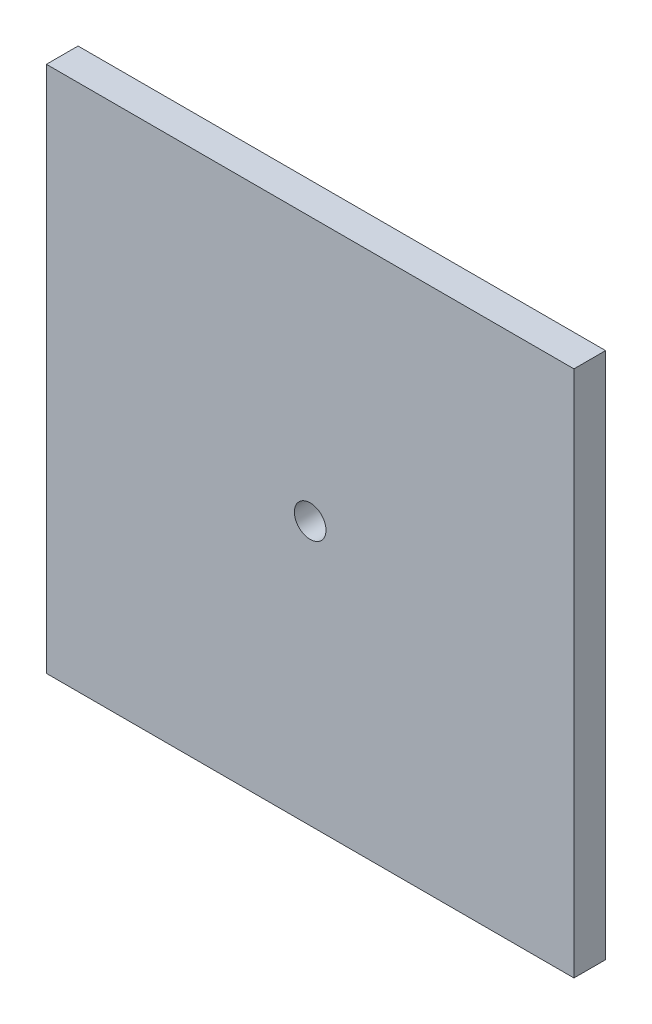
ISO-10303-21;
HEADER;
FILE_DESCRIPTION(('STEP AP214'),'2;1');
FILE_NAME('part.step','',(''),(''),'','','');
FILE_SCHEMA(('AUTOMOTIVE_DESIGN { 1 0 10303 214 1 1 1 1 }'));
ENDSEC;
DATA;
#1=APPLICATION_CONTEXT('core data for automotive mechanical design processes');
#2=APPLICATION_PROTOCOL_DEFINITION('international standard','automotive_design',2000,#1);
#3=PRODUCT_CONTEXT('',#1,'mechanical');
#4=PRODUCT('Part','Part','',(#3));
#5=PRODUCT_RELATED_PRODUCT_CATEGORY('part','',(#4));
#6=PRODUCT_DEFINITION_FORMATION('','',#4);
#7=PRODUCT_DEFINITION_CONTEXT('part definition',#1,'design');
#8=PRODUCT_DEFINITION('design','',#6,#7);
#9=PRODUCT_DEFINITION_SHAPE('','',#8);
#10=(LENGTH_UNIT() NAMED_UNIT(*) SI_UNIT(.MILLI.,.METRE.));
#11=(NAMED_UNIT(*) PLANE_ANGLE_UNIT() SI_UNIT($,.RADIAN.));
#12=(NAMED_UNIT(*) SI_UNIT($,.STERADIAN.) SOLID_ANGLE_UNIT());
#13=UNCERTAINTY_MEASURE_WITH_UNIT(LENGTH_MEASURE(1.E-05),#10,'distance_accuracy_value','');
#14=(GEOMETRIC_REPRESENTATION_CONTEXT(3) GLOBAL_UNCERTAINTY_ASSIGNED_CONTEXT((#13)) GLOBAL_UNIT_ASSIGNED_CONTEXT((#10,
#11,#12)) REPRESENTATION_CONTEXT('',''));
#15=CARTESIAN_POINT('',(0.,0.,0.));
#16=DIRECTION('',(0.,0.,1.));
#17=DIRECTION('',(1.,0.,0.));
#18=AXIS2_PLACEMENT_3D('',#15,#16,#17);
#19=CARTESIAN_POINT('',(25.,25.,3.));
#20=DIRECTION('',(-1.,0.,0.));
#21=DIRECTION('',(0.,-1.,0.));
#22=AXIS2_PLACEMENT_3D('',#19,#20,#21);
#23=PLANE('',#22);
#24=DIRECTION('',(0.,1.,0.));
#25=VECTOR('',#24,1.);
#26=CARTESIAN_POINT('',(25.,25.,0.));
#27=LINE('',#26,#25);
#28=CARTESIAN_POINT('',(25.,-25.,0.));
#29=VERTEX_POINT('',#28);
#30=CARTESIAN_POINT('',(25.,25.,0.));
#31=VERTEX_POINT('',#30);
#32=EDGE_CURVE('E99',#29,#31,#27,.T.);
#33=ORIENTED_EDGE('',*,*,#32,.T.);
#34=DIRECTION('',(0.,0.,-1.));
#35=VECTOR('',#34,1.);
#36=CARTESIAN_POINT('',(25.,25.,3.));
#37=LINE('',#36,#35);
#38=CARTESIAN_POINT('',(25.,25.,3.));
#39=VERTEX_POINT('',#38);
#40=EDGE_CURVE('E11',#39,#31,#37,.T.);
#41=ORIENTED_EDGE('',*,*,#40,.F.);
#42=DIRECTION('',(0.,1.,0.));
#43=VECTOR('',#42,1.);
#44=CARTESIAN_POINT('',(25.,25.,3.));
#45=LINE('',#44,#43);
#46=CARTESIAN_POINT('',(25.,-25.,3.));
#47=VERTEX_POINT('',#46);
#48=EDGE_CURVE('E87',#47,#39,#45,.T.);
#49=ORIENTED_EDGE('',*,*,#48,.F.);
#50=DIRECTION('',(0.,0.,-1.));
#51=VECTOR('',#50,1.);
#52=CARTESIAN_POINT('',(25.,-25.,3.));
#53=LINE('',#52,#51);
#54=EDGE_CURVE('E95',#47,#29,#53,.T.);
#55=ORIENTED_EDGE('',*,*,#54,.T.);
#56=EDGE_LOOP('',(#33,#41,#49,#55));
#57=FACE_BOUND('',#56,.T.);
#58=ADVANCED_FACE('F36',(#57),#23,.F.);
#59=CARTESIAN_POINT('',(-25.,25.,3.));
#60=DIRECTION('',(0.,-1.,0.));
#61=DIRECTION('',(0.,0.,-1.));
#62=AXIS2_PLACEMENT_3D('',#59,#60,#61);
#63=PLANE('',#62);
#64=DIRECTION('',(-1.,0.,0.));
#65=VECTOR('',#64,1.);
#66=CARTESIAN_POINT('',(-25.,25.,0.));
#67=LINE('',#66,#65);
#68=CARTESIAN_POINT('',(-25.,25.,0.));
#69=VERTEX_POINT('',#68);
#70=EDGE_CURVE('E91',#31,#69,#67,.T.);
#71=ORIENTED_EDGE('',*,*,#70,.T.);
#72=DIRECTION('',(0.,0.,-1.));
#73=VECTOR('',#72,1.);
#74=CARTESIAN_POINT('',(-25.,25.,3.));
#75=LINE('',#74,#73);
#76=CARTESIAN_POINT('',(-25.,25.,3.));
#77=VERTEX_POINT('',#76);
#78=EDGE_CURVE('E44',#77,#69,#75,.T.);
#79=ORIENTED_EDGE('',*,*,#78,.F.);
#80=DIRECTION('',(-1.,0.,0.));
#81=VECTOR('',#80,1.);
#82=CARTESIAN_POINT('',(-25.,25.,3.));
#83=LINE('',#82,#81);
#84=EDGE_CURVE('E82',#39,#77,#83,.T.);
#85=ORIENTED_EDGE('',*,*,#84,.F.);
#86=ORIENTED_EDGE('',*,*,#40,.T.);
#87=EDGE_LOOP('',(#71,#79,#85,#86));
#88=FACE_BOUND('',#87,.T.);
#89=ADVANCED_FACE('F90',(#88),#63,.F.);
#90=CARTESIAN_POINT('',(-25.,25.,3.));
#91=DIRECTION('',(1.,0.,0.));
#92=DIRECTION('',(0.,1.,0.));
#93=AXIS2_PLACEMENT_3D('',#90,#91,#92);
#94=PLANE('',#93);
#95=DIRECTION('',(0.,-1.,0.));
#96=VECTOR('',#95,1.);
#97=CARTESIAN_POINT('',(-25.,25.,0.));
#98=LINE('',#97,#96);
#99=CARTESIAN_POINT('',(-25.,-25.,0.));
#100=VERTEX_POINT('',#99);
#101=EDGE_CURVE('E69',#69,#100,#98,.T.);
#102=ORIENTED_EDGE('',*,*,#101,.T.);
#103=DIRECTION('',(0.,0.,-1.));
#104=VECTOR('',#103,1.);
#105=CARTESIAN_POINT('',(-25.,-25.,3.));
#106=LINE('',#105,#104);
#107=CARTESIAN_POINT('',(-25.,-25.,3.));
#108=VERTEX_POINT('',#107);
#109=EDGE_CURVE('E92',#108,#100,#106,.T.);
#110=ORIENTED_EDGE('',*,*,#109,.F.);
#111=DIRECTION('',(0.,-1.,0.));
#112=VECTOR('',#111,1.);
#113=CARTESIAN_POINT('',(-25.,25.,3.));
#114=LINE('',#113,#112);
#115=EDGE_CURVE('E85',#77,#108,#114,.T.);
#116=ORIENTED_EDGE('',*,*,#115,.F.);
#117=ORIENTED_EDGE('',*,*,#78,.T.);
#118=EDGE_LOOP('',(#102,#110,#116,#117));
#119=FACE_BOUND('',#118,.T.);
#120=ADVANCED_FACE('F93',(#119),#94,.F.);
#121=CARTESIAN_POINT('',(-25.,-25.,3.));
#122=DIRECTION('',(0.,1.,0.));
#123=DIRECTION('',(0.,0.,1.));
#124=AXIS2_PLACEMENT_3D('',#121,#122,#123);
#125=PLANE('',#124);
#126=DIRECTION('',(1.,0.,0.));
#127=VECTOR('',#126,1.);
#128=CARTESIAN_POINT('',(-25.,-25.,0.));
#129=LINE('',#128,#127);
#130=EDGE_CURVE('E75',#100,#29,#129,.T.);
#131=ORIENTED_EDGE('',*,*,#130,.T.);
#132=ORIENTED_EDGE('',*,*,#54,.F.);
#133=DIRECTION('',(1.,0.,0.));
#134=VECTOR('',#133,1.);
#135=CARTESIAN_POINT('',(-25.,-25.,3.));
#136=LINE('',#135,#134);
#137=EDGE_CURVE('E52',#108,#47,#136,.T.);
#138=ORIENTED_EDGE('',*,*,#137,.F.);
#139=ORIENTED_EDGE('',*,*,#109,.T.);
#140=EDGE_LOOP('',(#131,#132,#138,#139));
#141=FACE_BOUND('',#140,.T.);
#142=ADVANCED_FACE('F107',(#141),#125,.F.);
#143=CARTESIAN_POINT('',(0.,0.,3.));
#144=DIRECTION('',(0.,0.,1.));
#145=DIRECTION('',(1.,0.,0.));
#146=AXIS2_PLACEMENT_3D('',#143,#144,#145);
#147=PLANE('',#146);
#148=CARTESIAN_POINT('',(0.,0.,3.));
#149=DIRECTION('',(0.,0.,1.));
#150=DIRECTION('',(1.,0.,0.));
#151=AXIS2_PLACEMENT_3D('',#148,#149,#150);
#152=CIRCLE('',#151,1.5);
#153=CARTESIAN_POINT('',(1.5,0.,3.));
#154=VERTEX_POINT('',#153);
#155=EDGE_CURVE('E102',#154,#154,#152,.T.);
#156=ORIENTED_EDGE('',*,*,#155,.F.);
#157=EDGE_LOOP('',(#156));
#158=FACE_BOUND('',#157,.T.);
#159=ORIENTED_EDGE('',*,*,#48,.T.);
#160=ORIENTED_EDGE('',*,*,#84,.T.);
#161=ORIENTED_EDGE('',*,*,#115,.T.);
#162=ORIENTED_EDGE('',*,*,#137,.T.);
#163=EDGE_LOOP('',(#159,#160,#161,#162));
#164=FACE_BOUND('',#163,.T.);
#165=ADVANCED_FACE('F83',(#158,#164),#147,.T.);
#166=CARTESIAN_POINT('',(0.,0.,0.));
#167=DIRECTION('',(0.,0.,1.));
#168=DIRECTION('',(1.,0.,0.));
#169=AXIS2_PLACEMENT_3D('',#166,#167,#168);
#170=PLANE('',#169);
#171=CARTESIAN_POINT('',(0.,0.,0.));
#172=DIRECTION('',(0.,0.,1.));
#173=DIRECTION('',(1.,0.,0.));
#174=AXIS2_PLACEMENT_3D('',#171,#172,#173);
#175=CIRCLE('',#174,1.5);
#176=CARTESIAN_POINT('',(1.5,0.,0.));
#177=VERTEX_POINT('',#176);
#178=EDGE_CURVE('E115',#177,#177,#175,.T.);
#179=ORIENTED_EDGE('',*,*,#178,.T.);
#180=EDGE_LOOP('',(#179));
#181=FACE_BOUND('',#180,.T.);
#182=ORIENTED_EDGE('',*,*,#32,.F.);
#183=ORIENTED_EDGE('',*,*,#130,.F.);
#184=ORIENTED_EDGE('',*,*,#101,.F.);
#185=ORIENTED_EDGE('',*,*,#70,.F.);
#186=EDGE_LOOP('',(#182,#183,#184,#185));
#187=FACE_BOUND('',#186,.T.);
#188=ADVANCED_FACE('F110',(#181,#187),#170,.F.);
#189=CARTESIAN_POINT('',(0.,0.,0.));
#190=DIRECTION('',(0.,0.,1.));
#191=DIRECTION('',(1.,0.,0.));
#192=AXIS2_PLACEMENT_3D('',#189,#190,#191);
#193=CYLINDRICAL_SURFACE('',#192,1.5);
#194=ORIENTED_EDGE('',*,*,#155,.T.);
#195=EDGE_LOOP('',(#194));
#196=FACE_BOUND('',#195,.T.);
#197=ORIENTED_EDGE('',*,*,#178,.F.);
#198=EDGE_LOOP('',(#197));
#199=FACE_BOUND('',#198,.T.);
#200=ADVANCED_FACE('F120',(#196,#199),#193,.F.);
#201=CLOSED_SHELL('',(#58,#89,#120,#142,#165,#188,#200));
#202=MANIFOLD_SOLID_BREP('B2',#201);
#203=ADVANCED_BREP_SHAPE_REPRESENTATION('',(#18,#202),#14);
#204=SHAPE_DEFINITION_REPRESENTATION(#9,#203);
ENDSEC;
END-ISO-10303-21;
